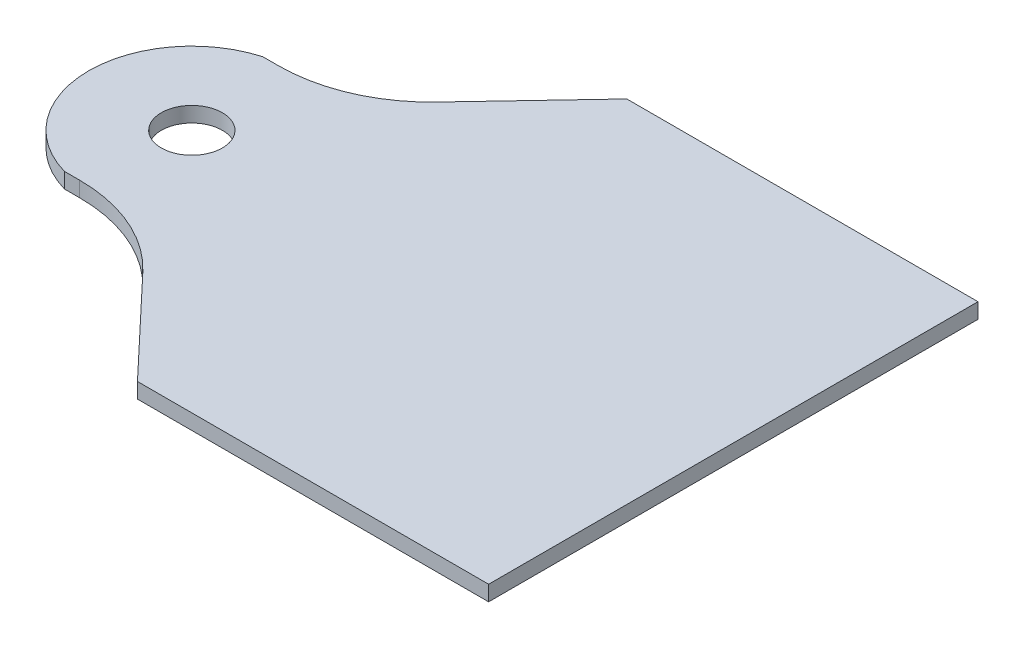
ISO-10303-21;
HEADER;
FILE_DESCRIPTION(('STEP AP214'),'2;1');
FILE_NAME('part.step','',(''),(''),'','','');
FILE_SCHEMA(('AUTOMOTIVE_DESIGN { 1 0 10303 214 1 1 1 1 }'));
ENDSEC;
DATA;
#1=APPLICATION_CONTEXT('core data for automotive mechanical design processes');
#2=APPLICATION_PROTOCOL_DEFINITION('international standard','automotive_design',2000,#1);
#3=PRODUCT_CONTEXT('',#1,'mechanical');
#4=PRODUCT('Part','Part','',(#3));
#5=PRODUCT_RELATED_PRODUCT_CATEGORY('part','',(#4));
#6=PRODUCT_DEFINITION_FORMATION('','',#4);
#7=PRODUCT_DEFINITION_CONTEXT('part definition',#1,'design');
#8=PRODUCT_DEFINITION('design','',#6,#7);
#9=PRODUCT_DEFINITION_SHAPE('','',#8);
#10=(LENGTH_UNIT() NAMED_UNIT(*) SI_UNIT(.MILLI.,.METRE.));
#11=(NAMED_UNIT(*) PLANE_ANGLE_UNIT() SI_UNIT($,.RADIAN.));
#12=(NAMED_UNIT(*) SI_UNIT($,.STERADIAN.) SOLID_ANGLE_UNIT());
#13=UNCERTAINTY_MEASURE_WITH_UNIT(LENGTH_MEASURE(1.E-05),#10,'distance_accuracy_value','');
#14=(GEOMETRIC_REPRESENTATION_CONTEXT(3) GLOBAL_UNCERTAINTY_ASSIGNED_CONTEXT((#13)) GLOBAL_UNIT_ASSIGNED_CONTEXT((#10,
#11,#12)) REPRESENTATION_CONTEXT('',''));
#15=CARTESIAN_POINT('',(0.,0.,0.));
#16=DIRECTION('',(0.,0.,1.));
#17=DIRECTION('',(1.,0.,0.));
#18=AXIS2_PLACEMENT_3D('',#15,#16,#17);
#19=CARTESIAN_POINT('',(-49.6181888185376,2.,-33.));
#20=DIRECTION('',(0.,-1.,0.));
#21=DIRECTION('',(0.,0.,-1.));
#22=AXIS2_PLACEMENT_3D('',#19,#20,#21);
#23=PLANE('',#22);
#24=DIRECTION('',(0.,0.,-1.));
#25=VECTOR('',#24,1.);
#26=CARTESIAN_POINT('',(23.,2.,32.05));
#27=LINE('',#26,#25);
#28=CARTESIAN_POINT('',(23.,2.,32.05));
#29=VERTEX_POINT('',#28);
#30=CARTESIAN_POINT('',(23.,2.,-32.05));
#31=VERTEX_POINT('',#30);
#32=EDGE_CURVE('E163',#29,#31,#27,.T.);
#33=ORIENTED_EDGE('',*,*,#32,.T.);
#34=DIRECTION('',(-1.,0.,0.));
#35=VECTOR('',#34,1.);
#36=CARTESIAN_POINT('',(-23.,2.,-32.05));
#37=LINE('',#36,#35);
#38=CARTESIAN_POINT('',(-23.,2.,-32.05));
#39=VERTEX_POINT('',#38);
#40=EDGE_CURVE('E101',#31,#39,#37,.T.);
#41=ORIENTED_EDGE('',*,*,#40,.T.);
#42=DIRECTION('',(-0.686791571283882,0.,0.726854412942108));
#43=VECTOR('',#42,1.);
#44=CARTESIAN_POINT('',(-35.0811005596953,2.,-19.2641685743224));
#45=LINE('',#44,#43);
#46=CARTESIAN_POINT('',(-35.0811005596953,2.,-19.2641685743224));
#47=VERTEX_POINT('',#46);
#48=EDGE_CURVE('E184',#39,#47,#45,.T.);
#49=ORIENTED_EDGE('',*,*,#48,.T.);
#50=CARTESIAN_POINT('',(-49.6181888185376,2.,-33.));
#51=DIRECTION('',(0.,-1.,0.));
#52=DIRECTION('',(0.,0.,-1.));
#53=AXIS2_PLACEMENT_3D('',#50,#51,#52);
#54=CIRCLE('',#53,20.);
#55=CARTESIAN_POINT('',(-49.6181888185376,2.,-13.));
#56=VERTEX_POINT('',#55);
#57=EDGE_CURVE('E203',#47,#56,#54,.T.);
#58=ORIENTED_EDGE('',*,*,#57,.T.);
#59=DIRECTION('',(-1.,0.,0.));
#60=VECTOR('',#59,1.);
#61=CARTESIAN_POINT('',(-49.6181888185376,2.,-13.));
#62=LINE('',#61,#60);
#63=CARTESIAN_POINT('',(-51.6181888185376,2.,-13.));
#64=VERTEX_POINT('',#63);
#65=EDGE_CURVE('E200',#56,#64,#62,.T.);
#66=ORIENTED_EDGE('',*,*,#65,.T.);
#67=CARTESIAN_POINT('',(-47.9272832278063,2.,0.));
#68=DIRECTION('',(0.,1.,0.));
#69=DIRECTION('',(0.,0.,1.));
#70=AXIS2_PLACEMENT_3D('',#67,#68,#69);
#71=CIRCLE('',#70,13.5137997646736);
#72=CARTESIAN_POINT('',(-51.6181888185376,2.,13.));
#73=VERTEX_POINT('',#72);
#74=EDGE_CURVE('E202',#64,#73,#71,.T.);
#75=ORIENTED_EDGE('',*,*,#74,.T.);
#76=DIRECTION('',(1.,0.,0.));
#77=VECTOR('',#76,1.);
#78=CARTESIAN_POINT('',(-49.6181888185376,2.,13.));
#79=LINE('',#78,#77);
#80=CARTESIAN_POINT('',(-49.6181888185376,2.,13.));
#81=VERTEX_POINT('',#80);
#82=EDGE_CURVE('E126',#73,#81,#79,.T.);
#83=ORIENTED_EDGE('',*,*,#82,.T.);
#84=CARTESIAN_POINT('',(-49.6181888185376,2.,33.));
#85=DIRECTION('',(0.,-1.,0.));
#86=DIRECTION('',(0.,0.,1.));
#87=AXIS2_PLACEMENT_3D('',#84,#85,#86);
#88=CIRCLE('',#87,20.);
#89=CARTESIAN_POINT('',(-35.0811005596953,2.,19.2641685743224));
#90=VERTEX_POINT('',#89);
#91=EDGE_CURVE('E120',#81,#90,#88,.T.);
#92=ORIENTED_EDGE('',*,*,#91,.T.);
#93=DIRECTION('',(0.686791571283882,0.,0.726854412942108));
#94=VECTOR('',#93,1.);
#95=CARTESIAN_POINT('',(-35.0811005596953,2.,19.2641685743224));
#96=LINE('',#95,#94);
#97=CARTESIAN_POINT('',(-23.,2.,32.05));
#98=VERTEX_POINT('',#97);
#99=EDGE_CURVE('E124',#90,#98,#96,.T.);
#100=ORIENTED_EDGE('',*,*,#99,.T.);
#101=DIRECTION('',(1.,0.,0.));
#102=VECTOR('',#101,1.);
#103=CARTESIAN_POINT('',(-23.,2.,32.05));
#104=LINE('',#103,#102);
#105=EDGE_CURVE('E52',#98,#29,#104,.T.);
#106=ORIENTED_EDGE('',*,*,#105,.T.);
#107=EDGE_LOOP('',(#33,#41,#49,#58,#66,#75,#83,#92,#100,#106));
#108=FACE_BOUND('',#107,.T.);
#109=CARTESIAN_POINT('',(-47.9272832278063,2.,0.));
#110=DIRECTION('',(0.,1.,0.));
#111=DIRECTION('',(0.,0.,1.));
#112=AXIS2_PLACEMENT_3D('',#109,#110,#111);
#113=CIRCLE('',#112,4.00000000000001);
#114=CARTESIAN_POINT('',(-47.9272832278063,2.,4.));
#115=VERTEX_POINT('',#114);
#116=EDGE_CURVE('E148',#115,#115,#113,.T.);
#117=ORIENTED_EDGE('',*,*,#116,.F.);
#118=EDGE_LOOP('',(#117));
#119=FACE_BOUND('',#118,.T.);
#120=ADVANCED_FACE('F35',(#108,#119),#23,.F.);
#121=CARTESIAN_POINT('',(-49.6181888185376,0.,-33.));
#122=DIRECTION('',(0.,-1.,0.));
#123=DIRECTION('',(0.,0.,-1.));
#124=AXIS2_PLACEMENT_3D('',#121,#122,#123);
#125=PLANE('',#124);
#126=DIRECTION('',(0.,0.,-1.));
#127=VECTOR('',#126,1.);
#128=CARTESIAN_POINT('',(23.,0.,32.05));
#129=LINE('',#128,#127);
#130=CARTESIAN_POINT('',(23.,0.,32.05));
#131=VERTEX_POINT('',#130);
#132=CARTESIAN_POINT('',(23.,0.,-32.05));
#133=VERTEX_POINT('',#132);
#134=EDGE_CURVE('E144',#131,#133,#129,.T.);
#135=ORIENTED_EDGE('',*,*,#134,.F.);
#136=DIRECTION('',(1.,0.,0.));
#137=VECTOR('',#136,1.);
#138=CARTESIAN_POINT('',(-23.,0.,32.05));
#139=LINE('',#138,#137);
#140=CARTESIAN_POINT('',(-23.,0.,32.05));
#141=VERTEX_POINT('',#140);
#142=EDGE_CURVE('E93',#141,#131,#139,.T.);
#143=ORIENTED_EDGE('',*,*,#142,.F.);
#144=DIRECTION('',(0.686791571283882,0.,0.726854412942108));
#145=VECTOR('',#144,1.);
#146=CARTESIAN_POINT('',(-35.0811005596953,0.,19.2641685743224));
#147=LINE('',#146,#145);
#148=CARTESIAN_POINT('',(-35.0811005596953,0.,19.2641685743224));
#149=VERTEX_POINT('',#148);
#150=EDGE_CURVE('E87',#149,#141,#147,.T.);
#151=ORIENTED_EDGE('',*,*,#150,.F.);
#152=CARTESIAN_POINT('',(-49.6181888185376,0.,33.));
#153=DIRECTION('',(0.,-1.,0.));
#154=DIRECTION('',(0.,0.,1.));
#155=AXIS2_PLACEMENT_3D('',#152,#153,#154);
#156=CIRCLE('',#155,20.);
#157=CARTESIAN_POINT('',(-49.6181888185376,0.,13.));
#158=VERTEX_POINT('',#157);
#159=EDGE_CURVE('E134',#158,#149,#156,.T.);
#160=ORIENTED_EDGE('',*,*,#159,.F.);
#161=DIRECTION('',(1.,0.,0.));
#162=VECTOR('',#161,1.);
#163=CARTESIAN_POINT('',(-49.6181888185376,0.,13.));
#164=LINE('',#163,#162);
#165=CARTESIAN_POINT('',(-51.6181888185376,0.,13.));
#166=VERTEX_POINT('',#165);
#167=EDGE_CURVE('E158',#166,#158,#164,.T.);
#168=ORIENTED_EDGE('',*,*,#167,.F.);
#169=CARTESIAN_POINT('',(-47.9272832278063,0.,0.));
#170=DIRECTION('',(0.,1.,0.));
#171=DIRECTION('',(0.,0.,1.));
#172=AXIS2_PLACEMENT_3D('',#169,#170,#171);
#173=CIRCLE('',#172,13.5137997646736);
#174=CARTESIAN_POINT('',(-51.6181888185376,0.,-13.));
#175=VERTEX_POINT('',#174);
#176=EDGE_CURVE('E156',#175,#166,#173,.T.);
#177=ORIENTED_EDGE('',*,*,#176,.F.);
#178=DIRECTION('',(-1.,0.,0.));
#179=VECTOR('',#178,1.);
#180=CARTESIAN_POINT('',(-49.6181888185376,0.,-13.));
#181=LINE('',#180,#179);
#182=CARTESIAN_POINT('',(-49.6181888185376,0.,-13.));
#183=VERTEX_POINT('',#182);
#184=EDGE_CURVE('E154',#183,#175,#181,.T.);
#185=ORIENTED_EDGE('',*,*,#184,.F.);
#186=CARTESIAN_POINT('',(-49.6181888185376,0.,-33.));
#187=DIRECTION('',(0.,-1.,0.));
#188=DIRECTION('',(0.,0.,-1.));
#189=AXIS2_PLACEMENT_3D('',#186,#187,#188);
#190=CIRCLE('',#189,20.);
#191=CARTESIAN_POINT('',(-35.0811005596953,0.,-19.2641685743224));
#192=VERTEX_POINT('',#191);
#193=EDGE_CURVE('E152',#192,#183,#190,.T.);
#194=ORIENTED_EDGE('',*,*,#193,.F.);
#195=DIRECTION('',(-0.686791571283882,0.,0.726854412942108));
#196=VECTOR('',#195,1.);
#197=CARTESIAN_POINT('',(-35.0811005596953,0.,-19.2641685743224));
#198=LINE('',#197,#196);
#199=CARTESIAN_POINT('',(-23.,0.,-32.05));
#200=VERTEX_POINT('',#199);
#201=EDGE_CURVE('E150',#200,#192,#198,.T.);
#202=ORIENTED_EDGE('',*,*,#201,.F.);
#203=DIRECTION('',(-1.,0.,0.));
#204=VECTOR('',#203,1.);
#205=CARTESIAN_POINT('',(-23.,0.,-32.05));
#206=LINE('',#205,#204);
#207=EDGE_CURVE('E147',#133,#200,#206,.T.);
#208=ORIENTED_EDGE('',*,*,#207,.F.);
#209=EDGE_LOOP('',(#135,#143,#151,#160,#168,#177,#185,#194,#202,#208));
#210=FACE_BOUND('',#209,.T.);
#211=CARTESIAN_POINT('',(-47.9272832278063,0.,0.));
#212=DIRECTION('',(0.,1.,0.));
#213=DIRECTION('',(0.,0.,1.));
#214=AXIS2_PLACEMENT_3D('',#211,#212,#213);
#215=CIRCLE('',#214,4.00000000000001);
#216=CARTESIAN_POINT('',(-47.9272832278063,0.,4.));
#217=VERTEX_POINT('',#216);
#218=EDGE_CURVE('E211',#217,#217,#215,.T.);
#219=ORIENTED_EDGE('',*,*,#218,.T.);
#220=EDGE_LOOP('',(#219));
#221=FACE_BOUND('',#220,.T.);
#222=ADVANCED_FACE('F188',(#210,#221),#125,.T.);
#223=CARTESIAN_POINT('',(23.,2.,32.05));
#224=DIRECTION('',(-1.,0.,0.));
#225=DIRECTION('',(0.,0.,1.));
#226=AXIS2_PLACEMENT_3D('',#223,#224,#225);
#227=PLANE('',#226);
#228=ORIENTED_EDGE('',*,*,#134,.T.);
#229=DIRECTION('',(0.,-1.,0.));
#230=VECTOR('',#229,1.);
#231=CARTESIAN_POINT('',(23.,2.,-32.05));
#232=LINE('',#231,#230);
#233=EDGE_CURVE('E11',#31,#133,#232,.T.);
#234=ORIENTED_EDGE('',*,*,#233,.F.);
#235=ORIENTED_EDGE('',*,*,#32,.F.);
#236=DIRECTION('',(0.,-1.,0.));
#237=VECTOR('',#236,1.);
#238=CARTESIAN_POINT('',(23.,2.,32.05));
#239=LINE('',#238,#237);
#240=EDGE_CURVE('E140',#29,#131,#239,.T.);
#241=ORIENTED_EDGE('',*,*,#240,.T.);
#242=EDGE_LOOP('',(#228,#234,#235,#241));
#243=FACE_BOUND('',#242,.T.);
#244=ADVANCED_FACE('F37',(#243),#227,.F.);
#245=CARTESIAN_POINT('',(-23.,2.,-32.05));
#246=DIRECTION('',(0.,0.,1.));
#247=DIRECTION('',(1.,0.,0.));
#248=AXIS2_PLACEMENT_3D('',#245,#246,#247);
#249=PLANE('',#248);
#250=ORIENTED_EDGE('',*,*,#207,.T.);
#251=DIRECTION('',(0.,-1.,0.));
#252=VECTOR('',#251,1.);
#253=CARTESIAN_POINT('',(-23.,2.,-32.05));
#254=LINE('',#253,#252);
#255=EDGE_CURVE('E44',#39,#200,#254,.T.);
#256=ORIENTED_EDGE('',*,*,#255,.F.);
#257=ORIENTED_EDGE('',*,*,#40,.F.);
#258=ORIENTED_EDGE('',*,*,#233,.T.);
#259=EDGE_LOOP('',(#250,#256,#257,#258));
#260=FACE_BOUND('',#259,.T.);
#261=ADVANCED_FACE('F247',(#260),#249,.F.);
#262=CARTESIAN_POINT('',(-35.0811005596953,2.,-19.2641685743224));
#263=DIRECTION('',(0.726854412942108,0.,0.686791571283882));
#264=DIRECTION('',(0.686791571283882,0.,-0.726854412942108));
#265=AXIS2_PLACEMENT_3D('',#262,#263,#264);
#266=PLANE('',#265);
#267=ORIENTED_EDGE('',*,*,#201,.T.);
#268=DIRECTION('',(0.,-1.,0.));
#269=VECTOR('',#268,1.);
#270=CARTESIAN_POINT('',(-35.0811005596953,2.,-19.2641685743224));
#271=LINE('',#270,#269);
#272=EDGE_CURVE('E176',#47,#192,#271,.T.);
#273=ORIENTED_EDGE('',*,*,#272,.F.);
#274=ORIENTED_EDGE('',*,*,#48,.F.);
#275=ORIENTED_EDGE('',*,*,#255,.T.);
#276=EDGE_LOOP('',(#267,#273,#274,#275));
#277=FACE_BOUND('',#276,.T.);
#278=ADVANCED_FACE('F182',(#277),#266,.F.);
#279=CARTESIAN_POINT('',(-49.6181888185376,2.,-33.));
#280=DIRECTION('',(0.,-1.,0.));
#281=DIRECTION('',(0.,0.,-1.));
#282=AXIS2_PLACEMENT_3D('',#279,#280,#281);
#283=CYLINDRICAL_SURFACE('',#282,20.);
#284=ORIENTED_EDGE('',*,*,#193,.T.);
#285=DIRECTION('',(0.,-1.,0.));
#286=VECTOR('',#285,1.);
#287=CARTESIAN_POINT('',(-49.6181888185376,2.,-13.));
#288=LINE('',#287,#286);
#289=EDGE_CURVE('E173',#56,#183,#288,.T.);
#290=ORIENTED_EDGE('',*,*,#289,.F.);
#291=ORIENTED_EDGE('',*,*,#57,.F.);
#292=ORIENTED_EDGE('',*,*,#272,.T.);
#293=EDGE_LOOP('',(#284,#290,#291,#292));
#294=FACE_BOUND('',#293,.T.);
#295=ADVANCED_FACE('F194',(#294),#283,.F.);
#296=CARTESIAN_POINT('',(-49.6181888185376,2.,-13.));
#297=DIRECTION('',(0.,0.,1.));
#298=DIRECTION('',(1.,0.,0.));
#299=AXIS2_PLACEMENT_3D('',#296,#297,#298);
#300=PLANE('',#299);
#301=ORIENTED_EDGE('',*,*,#184,.T.);
#302=DIRECTION('',(0.,-1.,0.));
#303=VECTOR('',#302,1.);
#304=CARTESIAN_POINT('',(-51.6181888185376,2.,-13.));
#305=LINE('',#304,#303);
#306=EDGE_CURVE('E170',#64,#175,#305,.T.);
#307=ORIENTED_EDGE('',*,*,#306,.F.);
#308=ORIENTED_EDGE('',*,*,#65,.F.);
#309=ORIENTED_EDGE('',*,*,#289,.T.);
#310=EDGE_LOOP('',(#301,#307,#308,#309));
#311=FACE_BOUND('',#310,.T.);
#312=ADVANCED_FACE('F198',(#311),#300,.F.);
#313=CARTESIAN_POINT('',(-47.9272832278063,2.,0.));
#314=DIRECTION('',(0.,-1.,0.));
#315=DIRECTION('',(0.,0.,-1.));
#316=AXIS2_PLACEMENT_3D('',#313,#314,#315);
#317=CYLINDRICAL_SURFACE('',#316,13.5137997646736);
#318=ORIENTED_EDGE('',*,*,#176,.T.);
#319=DIRECTION('',(0.,-1.,0.));
#320=VECTOR('',#319,1.);
#321=CARTESIAN_POINT('',(-51.6181888185376,2.,13.));
#322=LINE('',#321,#320);
#323=EDGE_CURVE('E167',#73,#166,#322,.T.);
#324=ORIENTED_EDGE('',*,*,#323,.F.);
#325=ORIENTED_EDGE('',*,*,#74,.F.);
#326=ORIENTED_EDGE('',*,*,#306,.T.);
#327=EDGE_LOOP('',(#318,#324,#325,#326));
#328=FACE_BOUND('',#327,.T.);
#329=ADVANCED_FACE('F237',(#328),#317,.T.);
#330=CARTESIAN_POINT('',(-49.6181888185376,2.,13.));
#331=DIRECTION('',(0.,0.,-1.));
#332=DIRECTION('',(-1.,0.,0.));
#333=AXIS2_PLACEMENT_3D('',#330,#331,#332);
#334=PLANE('',#333);
#335=ORIENTED_EDGE('',*,*,#167,.T.);
#336=DIRECTION('',(0.,-1.,0.));
#337=VECTOR('',#336,1.);
#338=CARTESIAN_POINT('',(-49.6181888185376,2.,13.));
#339=LINE('',#338,#337);
#340=EDGE_CURVE('E135',#81,#158,#339,.T.);
#341=ORIENTED_EDGE('',*,*,#340,.F.);
#342=ORIENTED_EDGE('',*,*,#82,.F.);
#343=ORIENTED_EDGE('',*,*,#323,.T.);
#344=EDGE_LOOP('',(#335,#341,#342,#343));
#345=FACE_BOUND('',#344,.T.);
#346=ADVANCED_FACE('F234',(#345),#334,.F.);
#347=CARTESIAN_POINT('',(-49.6181888185376,2.,33.));
#348=DIRECTION('',(0.,-1.,0.));
#349=DIRECTION('',(0.,0.,-1.));
#350=AXIS2_PLACEMENT_3D('',#347,#348,#349);
#351=CYLINDRICAL_SURFACE('',#350,20.);
#352=ORIENTED_EDGE('',*,*,#159,.T.);
#353=DIRECTION('',(0.,-1.,0.));
#354=VECTOR('',#353,1.);
#355=CARTESIAN_POINT('',(-35.0811005596953,2.,19.2641685743224));
#356=LINE('',#355,#354);
#357=EDGE_CURVE('E131',#90,#149,#356,.T.);
#358=ORIENTED_EDGE('',*,*,#357,.F.);
#359=ORIENTED_EDGE('',*,*,#91,.F.);
#360=ORIENTED_EDGE('',*,*,#340,.T.);
#361=EDGE_LOOP('',(#352,#358,#359,#360));
#362=FACE_BOUND('',#361,.T.);
#363=ADVANCED_FACE('F132',(#362),#351,.F.);
#364=CARTESIAN_POINT('',(-35.0811005596953,2.,19.2641685743224));
#365=DIRECTION('',(0.726854412942108,0.,-0.686791571283882));
#366=DIRECTION('',(-0.686791571283882,0.,-0.726854412942108));
#367=AXIS2_PLACEMENT_3D('',#364,#365,#366);
#368=PLANE('',#367);
#369=ORIENTED_EDGE('',*,*,#150,.T.);
#370=DIRECTION('',(0.,-1.,0.));
#371=VECTOR('',#370,1.);
#372=CARTESIAN_POINT('',(-23.,2.,32.05));
#373=LINE('',#372,#371);
#374=EDGE_CURVE('E136',#98,#141,#373,.T.);
#375=ORIENTED_EDGE('',*,*,#374,.F.);
#376=ORIENTED_EDGE('',*,*,#99,.F.);
#377=ORIENTED_EDGE('',*,*,#357,.T.);
#378=EDGE_LOOP('',(#369,#375,#376,#377));
#379=FACE_BOUND('',#378,.T.);
#380=ADVANCED_FACE('F138',(#379),#368,.F.);
#381=CARTESIAN_POINT('',(-23.,2.,32.05));
#382=DIRECTION('',(0.,0.,-1.));
#383=DIRECTION('',(-1.,0.,0.));
#384=AXIS2_PLACEMENT_3D('',#381,#382,#383);
#385=PLANE('',#384);
#386=ORIENTED_EDGE('',*,*,#142,.T.);
#387=ORIENTED_EDGE('',*,*,#240,.F.);
#388=ORIENTED_EDGE('',*,*,#105,.F.);
#389=ORIENTED_EDGE('',*,*,#374,.T.);
#390=EDGE_LOOP('',(#386,#387,#388,#389));
#391=FACE_BOUND('',#390,.T.);
#392=ADVANCED_FACE('F227',(#391),#385,.F.);
#393=CARTESIAN_POINT('',(-47.9272832278063,2.,0.));
#394=DIRECTION('',(0.,-1.,0.));
#395=DIRECTION('',(0.,0.,-1.));
#396=AXIS2_PLACEMENT_3D('',#393,#394,#395);
#397=CYLINDRICAL_SURFACE('',#396,4.00000000000001);
#398=ORIENTED_EDGE('',*,*,#116,.T.);
#399=EDGE_LOOP('',(#398));
#400=FACE_BOUND('',#399,.T.);
#401=ORIENTED_EDGE('',*,*,#218,.F.);
#402=EDGE_LOOP('',(#401));
#403=FACE_BOUND('',#402,.T.);
#404=ADVANCED_FACE('F217',(#400,#403),#397,.F.);
#405=CLOSED_SHELL('',(#120,#222,#244,#261,#278,#295,#312,#329,#346,#363,#380,#392,#404));
#406=MANIFOLD_SOLID_BREP('B2',#405);
#407=ADVANCED_BREP_SHAPE_REPRESENTATION('',(#18,#406),#14);
#408=SHAPE_DEFINITION_REPRESENTATION(#9,#407);
ENDSEC;
END-ISO-10303-21;
